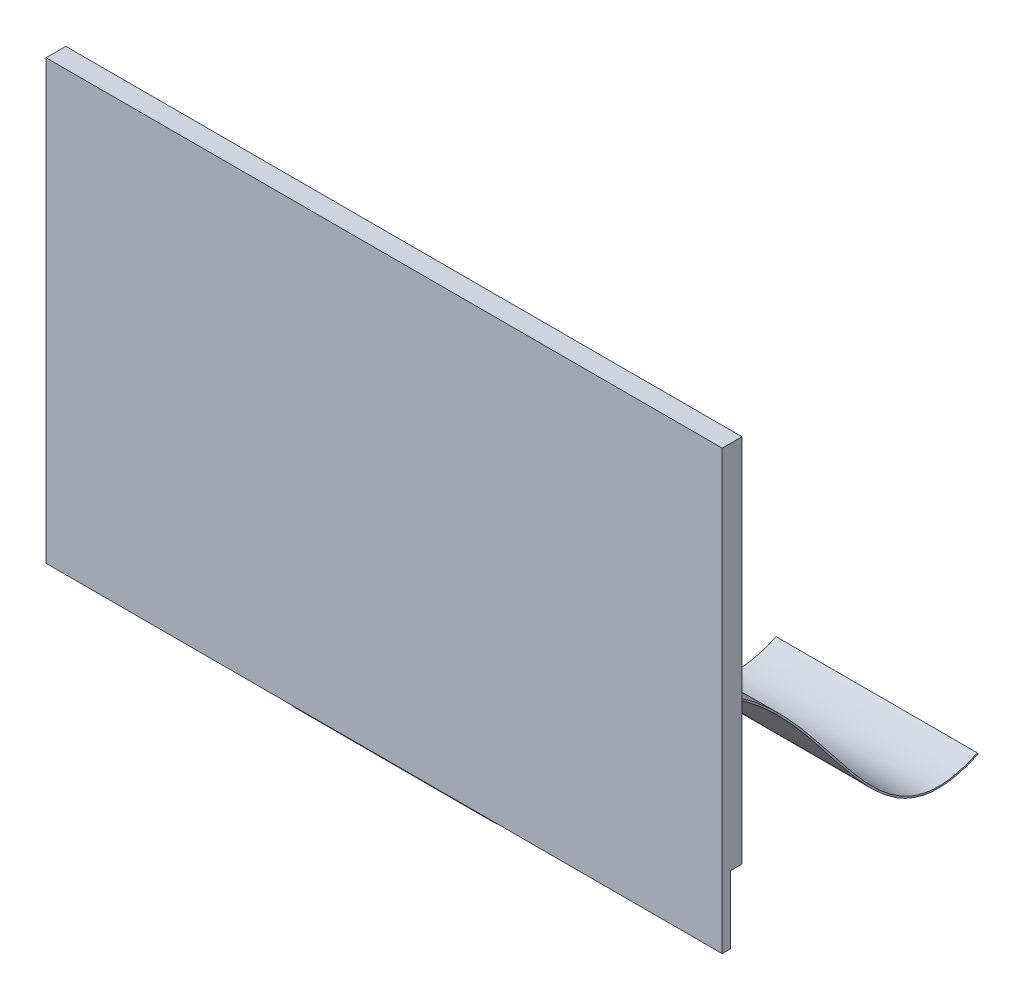
ISO-10303-21;
HEADER;
FILE_DESCRIPTION(('STEP AP214'),'2;1');
FILE_NAME('part.step','',(''),(''),'','','');
FILE_SCHEMA(('AUTOMOTIVE_DESIGN { 1 0 10303 214 1 1 1 1 }'));
ENDSEC;
DATA;
#1=APPLICATION_CONTEXT('core data for automotive mechanical design processes');
#2=APPLICATION_PROTOCOL_DEFINITION('international standard','automotive_design',2000,#1);
#3=PRODUCT_CONTEXT('',#1,'mechanical');
#4=PRODUCT('Part','Part','',(#3));
#5=PRODUCT_RELATED_PRODUCT_CATEGORY('part','',(#4));
#6=PRODUCT_DEFINITION_FORMATION('','',#4);
#7=PRODUCT_DEFINITION_CONTEXT('part definition',#1,'design');
#8=PRODUCT_DEFINITION('design','',#6,#7);
#9=PRODUCT_DEFINITION_SHAPE('','',#8);
#10=(LENGTH_UNIT() NAMED_UNIT(*) SI_UNIT(.MILLI.,.METRE.));
#11=(NAMED_UNIT(*) PLANE_ANGLE_UNIT() SI_UNIT($,.RADIAN.));
#12=(NAMED_UNIT(*) SI_UNIT($,.STERADIAN.) SOLID_ANGLE_UNIT());
#13=UNCERTAINTY_MEASURE_WITH_UNIT(LENGTH_MEASURE(1.E-05),#10,'distance_accuracy_value','');
#14=(GEOMETRIC_REPRESENTATION_CONTEXT(3) GLOBAL_UNCERTAINTY_ASSIGNED_CONTEXT((#13)) GLOBAL_UNIT_ASSIGNED_CONTEXT((#10,
#11,#12)) REPRESENTATION_CONTEXT('',''));
#15=CARTESIAN_POINT('',(0.,0.,0.));
#16=DIRECTION('',(0.,0.,1.));
#17=DIRECTION('',(1.,0.,0.));
#18=AXIS2_PLACEMENT_3D('',#15,#16,#17);
#19=CARTESIAN_POINT('',(-21.02,-13.61,0.52));
#20=DIRECTION('',(0.,1.,0.));
#21=DIRECTION('',(0.,0.,1.));
#22=AXIS2_PLACEMENT_3D('',#19,#20,#21);
#23=PLANE('',#22);
#24=DIRECTION('',(0.,0.,-1.));
#25=VECTOR('',#24,1.);
#26=CARTESIAN_POINT('',(6.26,-13.61,0.1));
#27=LINE('',#26,#25);
#28=CARTESIAN_POINT('',(6.26,-13.61,0.1));
#29=VERTEX_POINT('',#28);
#30=CARTESIAN_POINT('',(6.26,-13.61,0.));
#31=VERTEX_POINT('',#30);
#32=EDGE_CURVE('E149',#29,#31,#27,.T.);
#33=ORIENTED_EDGE('',*,*,#32,.T.);
#34=DIRECTION('',(1.,0.,0.));
#35=VECTOR('',#34,1.);
#36=CARTESIAN_POINT('',(-21.02,-13.61,0.));
#37=LINE('',#36,#35);
#38=CARTESIAN_POINT('',(21.02,-13.61,0.));
#39=VERTEX_POINT('',#38);
#40=EDGE_CURVE('E286',#31,#39,#37,.T.);
#41=ORIENTED_EDGE('',*,*,#40,.T.);
#42=DIRECTION('',(0.,0.,-1.));
#43=VECTOR('',#42,1.);
#44=CARTESIAN_POINT('',(21.02,-13.61,0.52));
#45=LINE('',#44,#43);
#46=CARTESIAN_POINT('',(21.02,-13.61,0.52));
#47=VERTEX_POINT('',#46);
#48=EDGE_CURVE('E282',#47,#39,#45,.T.);
#49=ORIENTED_EDGE('',*,*,#48,.F.);
#50=DIRECTION('',(1.,0.,0.));
#51=VECTOR('',#50,1.);
#52=CARTESIAN_POINT('',(-21.02,-13.61,0.52));
#53=LINE('',#52,#51);
#54=CARTESIAN_POINT('',(-21.02,-13.61,0.52));
#55=VERTEX_POINT('',#54);
#56=EDGE_CURVE('E280',#55,#47,#53,.T.);
#57=ORIENTED_EDGE('',*,*,#56,.F.);
#58=DIRECTION('',(0.,0.,-1.));
#59=VECTOR('',#58,1.);
#60=CARTESIAN_POINT('',(-21.02,-13.61,0.52));
#61=LINE('',#60,#59);
#62=CARTESIAN_POINT('',(-21.02,-13.61,0.));
#63=VERTEX_POINT('',#62);
#64=EDGE_CURVE('E290',#55,#63,#61,.T.);
#65=ORIENTED_EDGE('',*,*,#64,.T.);
#66=CARTESIAN_POINT('',(-6.26,-13.61,0.));
#67=VERTEX_POINT('',#66);
#68=EDGE_CURVE('E276',#63,#67,#37,.T.);
#69=ORIENTED_EDGE('',*,*,#68,.T.);
#70=DIRECTION('',(0.,0.,-1.));
#71=VECTOR('',#70,1.);
#72=CARTESIAN_POINT('',(-6.26,-13.61,0.1));
#73=LINE('',#72,#71);
#74=CARTESIAN_POINT('',(-6.26,-13.61,0.1));
#75=VERTEX_POINT('',#74);
#76=EDGE_CURVE('E62',#75,#67,#73,.T.);
#77=ORIENTED_EDGE('',*,*,#76,.F.);
#78=DIRECTION('',(-1.,0.,0.));
#79=VECTOR('',#78,1.);
#80=CARTESIAN_POINT('',(6.26,-13.61,0.1));
#81=LINE('',#80,#79);
#82=EDGE_CURVE('E57',#29,#75,#81,.T.);
#83=ORIENTED_EDGE('',*,*,#82,.F.);
#84=EDGE_LOOP('',(#33,#41,#49,#57,#65,#69,#77,#83));
#85=FACE_BOUND('',#84,.T.);
#86=ADVANCED_FACE('F42',(#85),#23,.F.);
#87=CARTESIAN_POINT('',(21.02,13.61,0.52));
#88=DIRECTION('',(-1.,0.,0.));
#89=DIRECTION('',(0.,0.,1.));
#90=AXIS2_PLACEMENT_3D('',#87,#88,#89);
#91=PLANE('',#90);
#92=DIRECTION('',(0.,1.,0.));
#93=VECTOR('',#92,1.);
#94=CARTESIAN_POINT('',(21.02,13.61,0.));
#95=LINE('',#94,#93);
#96=CARTESIAN_POINT('',(21.02,-9.40000000000001,0.));
#97=VERTEX_POINT('',#96);
#98=EDGE_CURVE('E272',#39,#97,#95,.T.);
#99=ORIENTED_EDGE('',*,*,#98,.T.);
#100=DIRECTION('',(0.,0.,1.));
#101=VECTOR('',#100,1.);
#102=CARTESIAN_POINT('',(21.02,-9.40000000000001,-0.71));
#103=LINE('',#102,#101);
#104=CARTESIAN_POINT('',(21.02,-9.40000000000001,-0.71));
#105=VERTEX_POINT('',#104);
#106=EDGE_CURVE('E255',#105,#97,#103,.T.);
#107=ORIENTED_EDGE('',*,*,#106,.F.);
#108=DIRECTION('',(0.,1.,0.));
#109=VECTOR('',#108,1.);
#110=CARTESIAN_POINT('',(21.02,13.61,-0.71));
#111=LINE('',#110,#109);
#112=CARTESIAN_POINT('',(21.02,13.61,-0.71));
#113=VERTEX_POINT('',#112);
#114=EDGE_CURVE('E253',#105,#113,#111,.T.);
#115=ORIENTED_EDGE('',*,*,#114,.T.);
#116=DIRECTION('',(0.,0.,-1.));
#117=VECTOR('',#116,1.);
#118=CARTESIAN_POINT('',(21.02,13.61,0.52));
#119=LINE('',#118,#117);
#120=CARTESIAN_POINT('',(21.02,13.61,0.52));
#121=VERTEX_POINT('',#120);
#122=EDGE_CURVE('E11',#121,#113,#119,.T.);
#123=ORIENTED_EDGE('',*,*,#122,.F.);
#124=DIRECTION('',(0.,1.,0.));
#125=VECTOR('',#124,1.);
#126=CARTESIAN_POINT('',(21.02,13.61,0.52));
#127=LINE('',#126,#125);
#128=EDGE_CURVE('E274',#47,#121,#127,.T.);
#129=ORIENTED_EDGE('',*,*,#128,.F.);
#130=ORIENTED_EDGE('',*,*,#48,.T.);
#131=EDGE_LOOP('',(#99,#107,#115,#123,#129,#130));
#132=FACE_BOUND('',#131,.T.);
#133=ADVANCED_FACE('F44',(#132),#91,.F.);
#134=CARTESIAN_POINT('',(-21.02,13.61,0.52));
#135=DIRECTION('',(0.,-1.,0.));
#136=DIRECTION('',(0.,0.,-1.));
#137=AXIS2_PLACEMENT_3D('',#134,#135,#136);
#138=PLANE('',#137);
#139=ORIENTED_EDGE('',*,*,#122,.T.);
#140=DIRECTION('',(-1.,0.,0.));
#141=VECTOR('',#140,1.);
#142=CARTESIAN_POINT('',(-21.02,13.61,-0.71));
#143=LINE('',#142,#141);
#144=CARTESIAN_POINT('',(-21.02,13.61,-0.71));
#145=VERTEX_POINT('',#144);
#146=EDGE_CURVE('E248',#113,#145,#143,.T.);
#147=ORIENTED_EDGE('',*,*,#146,.T.);
#148=DIRECTION('',(0.,0.,-1.));
#149=VECTOR('',#148,1.);
#150=CARTESIAN_POINT('',(-21.02,13.61,0.52));
#151=LINE('',#150,#149);
#152=CARTESIAN_POINT('',(-21.02,13.61,0.52));
#153=VERTEX_POINT('',#152);
#154=EDGE_CURVE('E50',#153,#145,#151,.T.);
#155=ORIENTED_EDGE('',*,*,#154,.F.);
#156=DIRECTION('',(-1.,0.,0.));
#157=VECTOR('',#156,1.);
#158=CARTESIAN_POINT('',(-21.02,13.61,0.52));
#159=LINE('',#158,#157);
#160=EDGE_CURVE('E249',#121,#153,#159,.T.);
#161=ORIENTED_EDGE('',*,*,#160,.F.);
#162=EDGE_LOOP('',(#139,#147,#155,#161));
#163=FACE_BOUND('',#162,.T.);
#164=ADVANCED_FACE('F235',(#163),#138,.F.);
#165=CARTESIAN_POINT('',(-21.02,13.61,0.52));
#166=DIRECTION('',(1.,0.,0.));
#167=DIRECTION('',(0.,0.,-1.));
#168=AXIS2_PLACEMENT_3D('',#165,#166,#167);
#169=PLANE('',#168);
#170=ORIENTED_EDGE('',*,*,#154,.T.);
#171=DIRECTION('',(0.,-1.,0.));
#172=VECTOR('',#171,1.);
#173=CARTESIAN_POINT('',(-21.02,13.61,-0.71));
#174=LINE('',#173,#172);
#175=CARTESIAN_POINT('',(-21.02,-9.40000000000001,-0.71));
#176=VERTEX_POINT('',#175);
#177=EDGE_CURVE('E262',#145,#176,#174,.T.);
#178=ORIENTED_EDGE('',*,*,#177,.T.);
#179=DIRECTION('',(0.,0.,1.));
#180=VECTOR('',#179,1.);
#181=CARTESIAN_POINT('',(-21.02,-9.40000000000001,-0.71));
#182=LINE('',#181,#180);
#183=CARTESIAN_POINT('',(-21.02,-9.40000000000001,0.));
#184=VERTEX_POINT('',#183);
#185=EDGE_CURVE('E263',#176,#184,#182,.T.);
#186=ORIENTED_EDGE('',*,*,#185,.T.);
#187=DIRECTION('',(0.,-1.,0.));
#188=VECTOR('',#187,1.);
#189=CARTESIAN_POINT('',(-21.02,13.61,0.));
#190=LINE('',#189,#188);
#191=EDGE_CURVE('E284',#184,#63,#190,.T.);
#192=ORIENTED_EDGE('',*,*,#191,.T.);
#193=ORIENTED_EDGE('',*,*,#64,.F.);
#194=DIRECTION('',(0.,-1.,0.));
#195=VECTOR('',#194,1.);
#196=CARTESIAN_POINT('',(-21.02,13.61,0.52));
#197=LINE('',#196,#195);
#198=EDGE_CURVE('E278',#153,#55,#197,.T.);
#199=ORIENTED_EDGE('',*,*,#198,.F.);
#200=EDGE_LOOP('',(#170,#178,#186,#192,#193,#199));
#201=FACE_BOUND('',#200,.T.);
#202=ADVANCED_FACE('F227',(#201),#169,.F.);
#203=CARTESIAN_POINT('',(0.,0.,0.52));
#204=DIRECTION('',(0.,0.,1.));
#205=DIRECTION('',(1.,0.,0.));
#206=AXIS2_PLACEMENT_3D('',#203,#204,#205);
#207=PLANE('',#206);
#208=ORIENTED_EDGE('',*,*,#128,.T.);
#209=ORIENTED_EDGE('',*,*,#160,.T.);
#210=ORIENTED_EDGE('',*,*,#198,.T.);
#211=ORIENTED_EDGE('',*,*,#56,.T.);
#212=EDGE_LOOP('',(#208,#209,#210,#211));
#213=FACE_BOUND('',#212,.T.);
#214=ADVANCED_FACE('F224',(#213),#207,.T.);
#215=CARTESIAN_POINT('',(0.,0.,0.));
#216=DIRECTION('',(0.,0.,1.));
#217=DIRECTION('',(1.,0.,0.));
#218=AXIS2_PLACEMENT_3D('',#215,#216,#217);
#219=PLANE('',#218);
#220=ORIENTED_EDGE('',*,*,#191,.F.);
#221=DIRECTION('',(1.,0.,0.));
#222=VECTOR('',#221,1.);
#223=CARTESIAN_POINT('',(-21.02,-9.40000000000001,0.));
#224=LINE('',#223,#222);
#225=EDGE_CURVE('E268',#184,#97,#224,.T.);
#226=ORIENTED_EDGE('',*,*,#225,.T.);
#227=ORIENTED_EDGE('',*,*,#98,.F.);
#228=ORIENTED_EDGE('',*,*,#40,.F.);
#229=DIRECTION('',(-1.,0.,0.));
#230=VECTOR('',#229,1.);
#231=CARTESIAN_POINT('',(6.26,-13.61,0.));
#232=LINE('',#231,#230);
#233=EDGE_CURVE('E333',#31,#67,#232,.T.);
#234=ORIENTED_EDGE('',*,*,#233,.T.);
#235=ORIENTED_EDGE('',*,*,#68,.F.);
#236=EDGE_LOOP('',(#220,#226,#227,#228,#234,#235));
#237=FACE_BOUND('',#236,.T.);
#238=ADVANCED_FACE('F222',(#237),#219,.F.);
#239=CARTESIAN_POINT('',(-21.02,-9.40000000000001,-0.71));
#240=DIRECTION('',(0.,-1.,0.));
#241=DIRECTION('',(0.,0.,-1.));
#242=AXIS2_PLACEMENT_3D('',#239,#240,#241);
#243=PLANE('',#242);
#244=ORIENTED_EDGE('',*,*,#225,.F.);
#245=ORIENTED_EDGE('',*,*,#185,.F.);
#246=DIRECTION('',(1.,0.,0.));
#247=VECTOR('',#246,1.);
#248=CARTESIAN_POINT('',(-21.02,-9.40000000000001,-0.71));
#249=LINE('',#248,#247);
#250=EDGE_CURVE('E258',#176,#105,#249,.T.);
#251=ORIENTED_EDGE('',*,*,#250,.T.);
#252=ORIENTED_EDGE('',*,*,#106,.T.);
#253=EDGE_LOOP('',(#244,#245,#251,#252));
#254=FACE_BOUND('',#253,.T.);
#255=ADVANCED_FACE('F218',(#254),#243,.T.);
#256=CARTESIAN_POINT('',(0.,0.,-0.71));
#257=DIRECTION('',(0.,0.,1.));
#258=DIRECTION('',(1.,0.,0.));
#259=AXIS2_PLACEMENT_3D('',#256,#257,#258);
#260=PLANE('',#259);
#261=ORIENTED_EDGE('',*,*,#177,.F.);
#262=ORIENTED_EDGE('',*,*,#146,.F.);
#263=ORIENTED_EDGE('',*,*,#114,.F.);
#264=ORIENTED_EDGE('',*,*,#250,.F.);
#265=EDGE_LOOP('',(#261,#262,#263,#264));
#266=FACE_BOUND('',#265,.T.);
#267=ADVANCED_FACE('F190',(#266),#260,.F.);
#268=CARTESIAN_POINT('',(6.26,-13.61,0.1));
#269=CARTESIAN_POINT('',(6.26,-13.8119999480466,0.1));
#270=CARTESIAN_POINT('',(6.26,-13.9837591338589,0.0624473965756092));
#271=CARTESIAN_POINT('',(6.26,-14.2668801117738,-0.0875974135172144));
#272=CARTESIAN_POINT('',(6.26,-14.3759055119008,-0.200229868315699));
#273=CARTESIAN_POINT('',(6.26,-14.6045417471325,-0.612932989829998));
#274=CARTESIAN_POINT('',(6.26,-14.6345643254958,-0.981626289978604));
#275=CARTESIAN_POINT('',(6.26,-14.5353817895923,-2.27533887372588));
#276=CARTESIAN_POINT('',(6.26,-14.2062646969254,-3.40138714632463));
#277=CARTESIAN_POINT('',(6.26,-13.8427121321428,-4.80890425704427));
#278=CARTESIAN_POINT('',(6.26,-13.7723365703956,-5.09018268287467));
#279=CARTESIAN_POINT('',(6.26,-13.6455466047876,-5.64338533772699));
#280=CARTESIAN_POINT('',(6.26,-13.5896211222009,-5.91499807970373));
#281=CARTESIAN_POINT('',(6.26,-13.4440720441727,-6.71545508621746));
#282=CARTESIAN_POINT('',(6.26,-13.3763854050504,-7.22986511615267));
#283=CARTESIAN_POINT('',(6.26,-13.2544437052941,-8.71887946130196));
#284=CARTESIAN_POINT('',(6.26,-13.2812813863851,-9.63924536657932));
#285=CARTESIAN_POINT('',(6.26,-13.6313167636837,-12.2120884436022));
#286=CARTESIAN_POINT('',(6.26,-14.2237080198093,-13.6768322646726));
#287=CARTESIAN_POINT('',(6.26,-15.8439048702194,-16.2569558783554));
#288=CARTESIAN_POINT('',(6.26,-16.8722309835674,-17.3719640574753));
#289=CARTESIAN_POINT('',(6.26,-20.1848865017766,-20.4038604885243));
#290=CARTESIAN_POINT('',(6.26,-22.69594954419,-22.0031304793632));
#291=CARTESIAN_POINT('',(6.26,-25.1893804891147,-24.6483898293702));
#292=CARTESIAN_POINT('',(6.26,-25.8096947336849,-25.5741102162512));
#293=CARTESIAN_POINT('',(6.26,-26.3172178707555,-27.6608434972548));
#294=CARTESIAN_POINT('',(6.26,-26.200070844383,-28.8171340446803));
#295=CARTESIAN_POINT('',(6.26,-25.5753361169583,-30.1427906614112));
#296=B_SPLINE_CURVE_WITH_KNOTS('',3,(#268,#269,#270,#271,#272,#273,#274,#275,#276,#277,#278,
#279,#280,#281,#282,#283,#284,#285,#286,#287,#288,#289,#290,#291,#292,#293,#294,#295),
.UNSPECIFIED.,.F.,.F.,(4,2,2,2,2,2,2,2,2,2,2,2,2,4),(0.,0.015625,0.03125,0.0625,0.125,0.140625,
0.15625,0.1875,0.25,0.375,0.5,0.75,0.875,1.),.UNSPECIFIED.);
#297=DIRECTION('',(-1.,0.,0.));
#298=VECTOR('',#297,1.);
#299=SURFACE_OF_LINEAR_EXTRUSION('',#296,#298);
#300=CARTESIAN_POINT('',(-6.26,-13.61,0.1));
#301=CARTESIAN_POINT('',(-6.26,-13.8119999480466,0.1));
#302=CARTESIAN_POINT('',(-6.26,-13.9837591338589,0.0624473965756092));
#303=CARTESIAN_POINT('',(-6.26,-14.2668801117738,-0.0875974135172144));
#304=CARTESIAN_POINT('',(-6.26,-14.3759055119008,-0.200229868315699));
#305=CARTESIAN_POINT('',(-6.26,-14.6045417471325,-0.612932989829998));
#306=CARTESIAN_POINT('',(-6.26,-14.6345643254958,-0.981626289978604));
#307=CARTESIAN_POINT('',(-6.26,-14.5353817895923,-2.27533887372588));
#308=CARTESIAN_POINT('',(-6.26,-14.2062646969254,-3.40138714632463));
#309=CARTESIAN_POINT('',(-6.26,-13.8427121321428,-4.80890425704427));
#310=CARTESIAN_POINT('',(-6.26,-13.7723365703956,-5.09018268287467));
#311=CARTESIAN_POINT('',(-6.26,-13.6455466047876,-5.64338533772699));
#312=CARTESIAN_POINT('',(-6.26,-13.5896211222009,-5.91499807970373));
#313=CARTESIAN_POINT('',(-6.26,-13.4440720441727,-6.71545508621746));
#314=CARTESIAN_POINT('',(-6.26,-13.3763854050504,-7.22986511615267));
#315=CARTESIAN_POINT('',(-6.26,-13.2544437052941,-8.71887946130196));
#316=CARTESIAN_POINT('',(-6.26,-13.2812813863851,-9.63924536657932));
#317=CARTESIAN_POINT('',(-6.26,-13.6313167636837,-12.2120884436022));
#318=CARTESIAN_POINT('',(-6.26,-14.2237080198093,-13.6768322646726));
#319=CARTESIAN_POINT('',(-6.26,-15.8439048702194,-16.2569558783554));
#320=CARTESIAN_POINT('',(-6.26,-16.8722309835674,-17.3719640574753));
#321=CARTESIAN_POINT('',(-6.26,-20.1848865017766,-20.4038604885243));
#322=CARTESIAN_POINT('',(-6.26,-22.69594954419,-22.0031304793632));
#323=CARTESIAN_POINT('',(-6.26,-25.1893804891147,-24.6483898293702));
#324=CARTESIAN_POINT('',(-6.26,-25.8096947336849,-25.5741102162512));
#325=CARTESIAN_POINT('',(-6.26,-26.3172178707555,-27.6608434972548));
#326=CARTESIAN_POINT('',(-6.26,-26.200070844383,-28.8171340446803));
#327=CARTESIAN_POINT('',(-6.26,-25.5753361169583,-30.1427906614112));
#328=B_SPLINE_CURVE_WITH_KNOTS('',3,(#300,#301,#302,#303,#304,#305,#306,#307,#308,#309,#310,
#311,#312,#313,#314,#315,#316,#317,#318,#319,#320,#321,#322,#323,#324,#325,#326,#327),
.UNSPECIFIED.,.F.,.F.,(4,2,2,2,2,2,2,2,2,2,2,2,2,4),(0.,0.015625,0.03125,0.0625,0.125,0.140625,
0.15625,0.1875,0.25,0.375,0.5,0.75,0.875,1.),.UNSPECIFIED.);
#329=CARTESIAN_POINT('',(-6.26,-25.5753361169583,-30.1427906614112));
#330=VERTEX_POINT('',#329);
#331=EDGE_CURVE('E156',#75,#330,#328,.T.);
#332=ORIENTED_EDGE('',*,*,#331,.T.);
#333=DIRECTION('',(-1.,0.,0.));
#334=VECTOR('',#333,1.);
#335=CARTESIAN_POINT('',(6.26,-25.5753361169583,-30.1427906614112));
#336=LINE('',#335,#334);
#337=CARTESIAN_POINT('',(6.26,-25.5753361169583,-30.1427906614112));
#338=VERTEX_POINT('',#337);
#339=EDGE_CURVE('E153',#338,#330,#336,.T.);
#340=ORIENTED_EDGE('',*,*,#339,.F.);
#341=EDGE_CURVE('E142',#29,#338,#296,.T.);
#342=ORIENTED_EDGE('',*,*,#341,.F.);
#343=ORIENTED_EDGE('',*,*,#82,.T.);
#344=EDGE_LOOP('',(#332,#340,#342,#343));
#345=FACE_BOUND('',#344,.T.);
#346=ADVANCED_FACE('F154',(#345),#299,.F.);
#347=CARTESIAN_POINT('',(6.26,-25.4848778243439,-30.1001608913286));
#348=DIRECTION('',(0.,0.426297700826143,-0.904582926143504));
#349=DIRECTION('',(0.,0.904582926143504,0.426297700826143));
#350=AXIS2_PLACEMENT_3D('',#347,#348,#349);
#351=PLANE('',#350);
#352=DIRECTION('',(0.,-0.904582926143504,-0.426297700826143));
#353=VECTOR('',#352,1.);
#354=CARTESIAN_POINT('',(-6.26,-25.4848778243439,-30.1001608913286));
#355=LINE('',#354,#353);
#356=CARTESIAN_POINT('',(-6.26,-25.4848778243439,-30.1001608913286));
#357=VERTEX_POINT('',#356);
#358=EDGE_CURVE('E342',#357,#330,#355,.T.);
#359=ORIENTED_EDGE('',*,*,#358,.F.);
#360=DIRECTION('',(-1.,0.,0.));
#361=VECTOR('',#360,1.);
#362=CARTESIAN_POINT('',(6.26,-25.4848778243439,-30.1001608913286));
#363=LINE('',#362,#361);
#364=CARTESIAN_POINT('',(6.26,-25.4848778243439,-30.1001608913286));
#365=VERTEX_POINT('',#364);
#366=EDGE_CURVE('E161',#365,#357,#363,.T.);
#367=ORIENTED_EDGE('',*,*,#366,.F.);
#368=DIRECTION('',(0.,-0.904582926143504,-0.426297700826143));
#369=VECTOR('',#368,1.);
#370=CARTESIAN_POINT('',(6.26,-25.4848778243439,-30.1001608913286));
#371=LINE('',#370,#369);
#372=EDGE_CURVE('E147',#365,#338,#371,.T.);
#373=ORIENTED_EDGE('',*,*,#372,.T.);
#374=ORIENTED_EDGE('',*,*,#339,.T.);
#375=EDGE_LOOP('',(#359,#367,#373,#374));
#376=FACE_BOUND('',#375,.T.);
#377=ADVANCED_FACE('F163',(#376),#351,.T.);
#378=CARTESIAN_POINT('',(6.26,-13.61,0.));
#379=CARTESIAN_POINT('',(6.26,-15.3456474147225,0.));
#380=CARTESIAN_POINT('',(6.26,-6.95499807479918,-20.5579202427928));
#381=CARTESIAN_POINT('',(6.26,-29.7170133786802,-21.1197756906614));
#382=CARTESIAN_POINT('',(6.26,-25.4848778243439,-30.1001608913286));
#383=B_SPLINE_CURVE_WITH_KNOTS('',3,(#378,#379,#380,#381,#382),.UNSPECIFIED.,.F.,.F.,(4,1,4),
(0.,0.142988606448873,1.),.UNSPECIFIED.);
#384=DIRECTION('',(-1.,0.,0.));
#385=VECTOR('',#384,1.);
#386=SURFACE_OF_LINEAR_EXTRUSION('',#383,#385);
#387=CARTESIAN_POINT('',(-6.26,-13.61,0.));
#388=CARTESIAN_POINT('',(-6.26,-15.3456474147225,0.));
#389=CARTESIAN_POINT('',(-6.26,-6.95499807479918,-20.5579202427928));
#390=CARTESIAN_POINT('',(-6.26,-29.7170133786802,-21.1197756906614));
#391=CARTESIAN_POINT('',(-6.26,-25.4848778243439,-30.1001608913286));
#392=B_SPLINE_CURVE_WITH_KNOTS('',3,(#387,#388,#389,#390,#391),.UNSPECIFIED.,.F.,.F.,(4,1,4),
(0.,0.142988606448873,1.),.UNSPECIFIED.);
#393=EDGE_CURVE('E337',#67,#357,#392,.T.);
#394=ORIENTED_EDGE('',*,*,#393,.F.);
#395=ORIENTED_EDGE('',*,*,#233,.F.);
#396=EDGE_CURVE('E164',#31,#365,#383,.T.);
#397=ORIENTED_EDGE('',*,*,#396,.T.);
#398=ORIENTED_EDGE('',*,*,#366,.T.);
#399=EDGE_LOOP('',(#394,#395,#397,#398));
#400=FACE_BOUND('',#399,.T.);
#401=ADVANCED_FACE('F179',(#400),#386,.T.);
#402=CARTESIAN_POINT('',(6.26,-17.9764494896371,-18.3825962011583));
#403=DIRECTION('',(-1.,0.,0.));
#404=DIRECTION('',(0.,0.,1.));
#405=AXIS2_PLACEMENT_3D('',#402,#403,#404);
#406=PLANE('',#405);
#407=ORIENTED_EDGE('',*,*,#341,.T.);
#408=ORIENTED_EDGE('',*,*,#372,.F.);
#409=ORIENTED_EDGE('',*,*,#396,.F.);
#410=ORIENTED_EDGE('',*,*,#32,.F.);
#411=EDGE_LOOP('',(#407,#408,#409,#410));
#412=FACE_BOUND('',#411,.T.);
#413=ADVANCED_FACE('F144',(#412),#406,.F.);
#414=CARTESIAN_POINT('',(-6.26,-17.9764494896371,-18.3825962011583));
#415=DIRECTION('',(-1.,0.,0.));
#416=DIRECTION('',(0.,0.,1.));
#417=AXIS2_PLACEMENT_3D('',#414,#415,#416);
#418=PLANE('',#417);
#419=ORIENTED_EDGE('',*,*,#331,.F.);
#420=ORIENTED_EDGE('',*,*,#76,.T.);
#421=ORIENTED_EDGE('',*,*,#393,.T.);
#422=ORIENTED_EDGE('',*,*,#358,.T.);
#423=EDGE_LOOP('',(#419,#420,#421,#422));
#424=FACE_BOUND('',#423,.T.);
#425=ADVANCED_FACE('F184',(#424),#418,.T.);
#426=CLOSED_SHELL('',(#86,#133,#164,#202,#214,#238,#255,#267,#346,#377,#401,#413,#425));
#427=CARTESIAN_POINT('',(-17.525,9.76499999999999,-0.01));
#428=DIRECTION('',(-1.,0.,0.));
#429=DIRECTION('',(0.,-1.,0.));
#430=AXIS2_PLACEMENT_3D('',#427,#428,#429);
#431=PLANE('',#430);
#432=DIRECTION('',(0.,-1.,0.));
#433=VECTOR('',#432,1.);
#434=CARTESIAN_POINT('',(-17.525,9.76499999999999,0.));
#435=LINE('',#434,#433);
#436=CARTESIAN_POINT('',(-17.525,9.76499999999999,0.));
#437=VERTEX_POINT('',#436);
#438=CARTESIAN_POINT('',(-17.525,-5.55500000000002,0.));
#439=VERTEX_POINT('',#438);
#440=EDGE_CURVE('E160',#437,#439,#435,.T.);
#441=ORIENTED_EDGE('',*,*,#440,.T.);
#442=DIRECTION('',(0.,0.,1.));
#443=VECTOR('',#442,1.);
#444=CARTESIAN_POINT('',(-17.525,-5.55500000000002,-0.01));
#445=LINE('',#444,#443);
#446=CARTESIAN_POINT('',(-17.525,-5.55500000000002,-0.01));
#447=VERTEX_POINT('',#446);
#448=EDGE_CURVE('E302',#447,#439,#445,.T.);
#449=ORIENTED_EDGE('',*,*,#448,.F.);
#450=DIRECTION('',(0.,-1.,0.));
#451=VECTOR('',#450,1.);
#452=CARTESIAN_POINT('',(-17.525,9.76499999999999,-0.01));
#453=LINE('',#452,#451);
#454=CARTESIAN_POINT('',(-17.525,9.76499999999999,-0.01));
#455=VERTEX_POINT('',#454);
#456=EDGE_CURVE('E313',#455,#447,#453,.T.);
#457=ORIENTED_EDGE('',*,*,#456,.F.);
#458=DIRECTION('',(0.,0.,1.));
#459=VECTOR('',#458,1.);
#460=CARTESIAN_POINT('',(-17.525,9.76499999999999,-0.01));
#461=LINE('',#460,#459);
#462=EDGE_CURVE('E271',#455,#437,#461,.T.);
#463=ORIENTED_EDGE('',*,*,#462,.T.);
#464=EDGE_LOOP('',(#441,#449,#457,#463));
#465=FACE_BOUND('',#464,.T.);
#466=ADVANCED_FACE('F205',(#465),#431,.F.);
#467=CARTESIAN_POINT('',(-17.525,9.76499999999999,-0.01));
#468=DIRECTION('',(0.,1.,0.));
#469=DIRECTION('',(-1.,0.,0.));
#470=AXIS2_PLACEMENT_3D('',#467,#468,#469);
#471=PLANE('',#470);
#472=DIRECTION('',(-1.,0.,0.));
#473=VECTOR('',#472,1.);
#474=CARTESIAN_POINT('',(-17.525,9.76499999999999,0.));
#475=LINE('',#474,#473);
#476=CARTESIAN_POINT('',(17.525,9.76499999999999,0.));
#477=VERTEX_POINT('',#476);
#478=EDGE_CURVE('E310',#477,#437,#475,.T.);
#479=ORIENTED_EDGE('',*,*,#478,.T.);
#480=ORIENTED_EDGE('',*,*,#462,.F.);
#481=DIRECTION('',(-1.,0.,0.));
#482=VECTOR('',#481,1.);
#483=CARTESIAN_POINT('',(-17.525,9.76499999999999,-0.01));
#484=LINE('',#483,#482);
#485=CARTESIAN_POINT('',(17.525,9.76499999999999,-0.01));
#486=VERTEX_POINT('',#485);
#487=EDGE_CURVE('E305',#486,#455,#484,.T.);
#488=ORIENTED_EDGE('',*,*,#487,.F.);
#489=DIRECTION('',(0.,0.,1.));
#490=VECTOR('',#489,1.);
#491=CARTESIAN_POINT('',(17.525,9.76499999999999,-0.01));
#492=LINE('',#491,#490);
#493=EDGE_CURVE('E307',#486,#477,#492,.T.);
#494=ORIENTED_EDGE('',*,*,#493,.T.);
#495=EDGE_LOOP('',(#479,#480,#488,#494));
#496=FACE_BOUND('',#495,.T.);
#497=ADVANCED_FACE('F201',(#496),#471,.F.);
#498=CARTESIAN_POINT('',(17.525,9.76499999999999,-0.01));
#499=DIRECTION('',(1.,0.,0.));
#500=DIRECTION('',(0.,0.,-1.));
#501=AXIS2_PLACEMENT_3D('',#498,#499,#500);
#502=PLANE('',#501);
#503=DIRECTION('',(0.,1.,0.));
#504=VECTOR('',#503,1.);
#505=CARTESIAN_POINT('',(17.525,9.76499999999999,0.));
#506=LINE('',#505,#504);
#507=CARTESIAN_POINT('',(17.525,-5.55500000000001,0.));
#508=VERTEX_POINT('',#507);
#509=EDGE_CURVE('E314',#508,#477,#506,.T.);
#510=ORIENTED_EDGE('',*,*,#509,.T.);
#511=ORIENTED_EDGE('',*,*,#493,.F.);
#512=DIRECTION('',(0.,1.,0.));
#513=VECTOR('',#512,1.);
#514=CARTESIAN_POINT('',(17.525,9.76499999999999,-0.01));
#515=LINE('',#514,#513);
#516=CARTESIAN_POINT('',(17.525,-5.55500000000001,-0.01));
#517=VERTEX_POINT('',#516);
#518=EDGE_CURVE('E324',#517,#486,#515,.T.);
#519=ORIENTED_EDGE('',*,*,#518,.F.);
#520=DIRECTION('',(0.,0.,1.));
#521=VECTOR('',#520,1.);
#522=CARTESIAN_POINT('',(17.525,-5.55500000000001,-0.01));
#523=LINE('',#522,#521);
#524=EDGE_CURVE('E304',#517,#508,#523,.T.);
#525=ORIENTED_EDGE('',*,*,#524,.T.);
#526=EDGE_LOOP('',(#510,#511,#519,#525));
#527=FACE_BOUND('',#526,.T.);
#528=ADVANCED_FACE('F204',(#527),#502,.F.);
#529=CARTESIAN_POINT('',(-17.525,-5.55500000000002,-0.01));
#530=DIRECTION('',(0.,-1.,0.));
#531=DIRECTION('',(1.,0.,0.));
#532=AXIS2_PLACEMENT_3D('',#529,#530,#531);
#533=PLANE('',#532);
#534=DIRECTION('',(1.,0.,0.));
#535=VECTOR('',#534,1.);
#536=CARTESIAN_POINT('',(-17.525,-5.55500000000002,0.));
#537=LINE('',#536,#535);
#538=EDGE_CURVE('E317',#439,#508,#537,.T.);
#539=ORIENTED_EDGE('',*,*,#538,.T.);
#540=ORIENTED_EDGE('',*,*,#524,.F.);
#541=DIRECTION('',(1.,0.,0.));
#542=VECTOR('',#541,1.);
#543=CARTESIAN_POINT('',(-17.525,-5.55500000000002,-0.01));
#544=LINE('',#543,#542);
#545=EDGE_CURVE('E327',#447,#517,#544,.T.);
#546=ORIENTED_EDGE('',*,*,#545,.F.);
#547=ORIENTED_EDGE('',*,*,#448,.T.);
#548=EDGE_LOOP('',(#539,#540,#546,#547));
#549=FACE_BOUND('',#548,.T.);
#550=ADVANCED_FACE('F195',(#549),#533,.F.);
#551=CARTESIAN_POINT('',(0.,0.,-0.01));
#552=DIRECTION('',(0.,0.,1.));
#553=DIRECTION('',(1.,0.,0.));
#554=AXIS2_PLACEMENT_3D('',#551,#552,#553);
#555=PLANE('',#554);
#556=ORIENTED_EDGE('',*,*,#456,.T.);
#557=ORIENTED_EDGE('',*,*,#545,.T.);
#558=ORIENTED_EDGE('',*,*,#518,.T.);
#559=ORIENTED_EDGE('',*,*,#487,.T.);
#560=EDGE_LOOP('',(#556,#557,#558,#559));
#561=FACE_BOUND('',#560,.T.);
#562=ADVANCED_FACE('F191',(#561),#555,.T.);
#563=CARTESIAN_POINT('',(0.,0.,0.));
#564=DIRECTION('',(0.,0.,1.));
#565=DIRECTION('',(1.,0.,0.));
#566=AXIS2_PLACEMENT_3D('',#563,#564,#565);
#567=PLANE('',#566);
#568=ORIENTED_EDGE('',*,*,#440,.F.);
#569=ORIENTED_EDGE('',*,*,#478,.F.);
#570=ORIENTED_EDGE('',*,*,#509,.F.);
#571=ORIENTED_EDGE('',*,*,#538,.F.);
#572=EDGE_LOOP('',(#568,#569,#570,#571));
#573=FACE_BOUND('',#572,.T.);
#574=ADVANCED_FACE('F194',(#573),#567,.F.);
#575=CLOSED_SHELL('',(#466,#497,#528,#550,#562,#574));
#576=ORIENTED_CLOSED_SHELL('',*,#575,.T.);
#577=BREP_WITH_VOIDS('B2',#426,(#576));
#578=ADVANCED_BREP_SHAPE_REPRESENTATION('',(#18,#577),#14);
#579=SHAPE_DEFINITION_REPRESENTATION(#9,#578);
ENDSEC;
END-ISO-10303-21;
